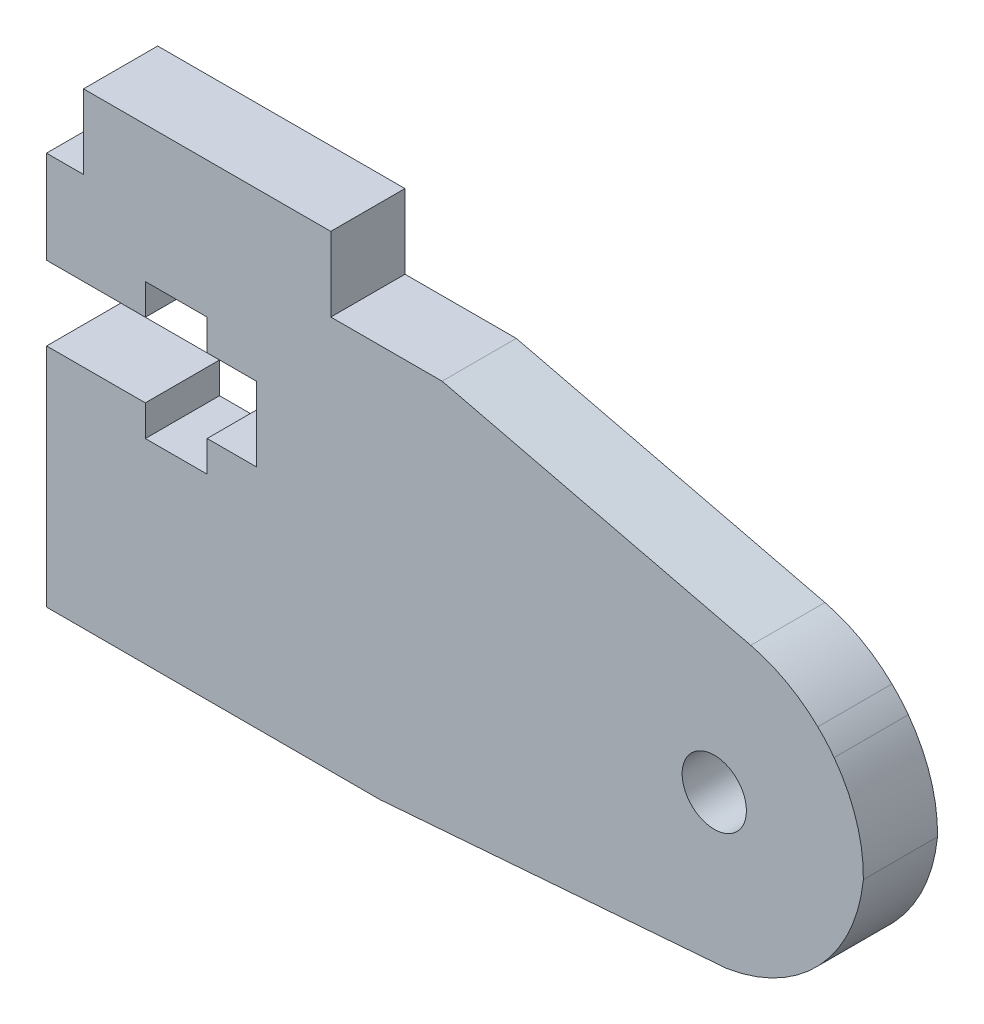
ISO-10303-21;
HEADER;
FILE_DESCRIPTION(('STEP AP214'),'2;1');
FILE_NAME('part.step','',(''),(''),'','','');
FILE_SCHEMA(('AUTOMOTIVE_DESIGN { 1 0 10303 214 1 1 1 1 }'));
ENDSEC;
DATA;
#1=APPLICATION_CONTEXT('core data for automotive mechanical design processes');
#2=APPLICATION_PROTOCOL_DEFINITION('international standard','automotive_design',2000,#1);
#3=PRODUCT_CONTEXT('',#1,'mechanical');
#4=PRODUCT('Part','Part','',(#3));
#5=PRODUCT_RELATED_PRODUCT_CATEGORY('part','',(#4));
#6=PRODUCT_DEFINITION_FORMATION('','',#4);
#7=PRODUCT_DEFINITION_CONTEXT('part definition',#1,'design');
#8=PRODUCT_DEFINITION('design','',#6,#7);
#9=PRODUCT_DEFINITION_SHAPE('','',#8);
#10=(LENGTH_UNIT() NAMED_UNIT(*) SI_UNIT(.MILLI.,.METRE.));
#11=(NAMED_UNIT(*) PLANE_ANGLE_UNIT() SI_UNIT($,.RADIAN.));
#12=(NAMED_UNIT(*) SI_UNIT($,.STERADIAN.) SOLID_ANGLE_UNIT());
#13=UNCERTAINTY_MEASURE_WITH_UNIT(LENGTH_MEASURE(1.E-05),#10,'distance_accuracy_value','');
#14=(GEOMETRIC_REPRESENTATION_CONTEXT(3) GLOBAL_UNCERTAINTY_ASSIGNED_CONTEXT((#13)) GLOBAL_UNIT_ASSIGNED_CONTEXT((#10,
#11,#12)) REPRESENTATION_CONTEXT('',''));
#15=CARTESIAN_POINT('',(0.,0.,0.));
#16=DIRECTION('',(0.,0.,1.));
#17=DIRECTION('',(1.,0.,0.));
#18=AXIS2_PLACEMENT_3D('',#15,#16,#17);
#19=CARTESIAN_POINT('',(2394.87260993681,1568.82173299491,3.));
#20=DIRECTION('',(0.,0.,1.));
#21=DIRECTION('',(1.,0.,0.));
#22=AXIS2_PLACEMENT_3D('',#19,#20,#21);
#23=PLANE('',#22);
#24=DIRECTION('',(0.000790245582121312,-0.999999687755911,0.));
#25=VECTOR('',#24,1.);
#26=CARTESIAN_POINT('',(2368.43482788486,1577.07900171005,3.));
#27=LINE('',#26,#25);
#28=CARTESIAN_POINT('',(2368.43482788486,1577.07900171005,3.));
#29=VERTEX_POINT('',#28);
#30=CARTESIAN_POINT('',(2368.43779125457,1573.32906770271,3.));
#31=VERTEX_POINT('',#30);
#32=EDGE_CURVE('E317',#29,#31,#27,.T.);
#33=ORIENTED_EDGE('',*,*,#32,.T.);
#34=DIRECTION('',(0.999999690037696,0.000787352850806013,0.));
#35=VECTOR('',#34,1.);
#36=CARTESIAN_POINT('',(2368.43779125457,1573.32906770271,3.));
#37=LINE('',#36,#35);
#38=CARTESIAN_POINT('',(2372.43777914393,1573.33221710555,3.));
#39=VERTEX_POINT('',#38);
#40=EDGE_CURVE('E151',#31,#39,#37,.T.);
#41=ORIENTED_EDGE('',*,*,#40,.T.);
#42=DIRECTION('',(-0.000787352849940315,0.999999690037697,0.));
#43=VECTOR('',#42,1.);
#44=CARTESIAN_POINT('',(2372.43777914393,1573.33221710555,3.));
#45=LINE('',#44,#43);
#46=CARTESIAN_POINT('',(2372.43679495286,1574.5822167181,3.));
#47=VERTEX_POINT('',#46);
#48=EDGE_CURVE('E406',#39,#47,#45,.T.);
#49=ORIENTED_EDGE('',*,*,#48,.T.);
#50=DIRECTION('',(0.999999690037696,0.00078735285059927,0.));
#51=VECTOR('',#50,1.);
#52=CARTESIAN_POINT('',(2372.43679495286,1574.5822167181,3.));
#53=LINE('',#52,#51);
#54=CARTESIAN_POINT('',(2374.92933215026,1574.58417922498,3.));
#55=VERTEX_POINT('',#54);
#56=EDGE_CURVE('E426',#47,#55,#53,.T.);
#57=ORIENTED_EDGE('',*,*,#56,.T.);
#58=DIRECTION('',(0.000787352851006129,-0.999999690037696,0.));
#59=VECTOR('',#58,1.);
#60=CARTESIAN_POINT('',(2374.92933215026,1574.58417922498,3.));
#61=LINE('',#60,#59);
#62=CARTESIAN_POINT('',(2374.93031634132,1573.33417961243,3.));
#63=VERTEX_POINT('',#62);
#64=EDGE_CURVE('E422',#55,#63,#61,.T.);
#65=ORIENTED_EDGE('',*,*,#64,.T.);
#66=DIRECTION('',(0.999999690037696,0.000787352851028333,0.));
#67=VECTOR('',#66,1.);
#68=CARTESIAN_POINT('',(2374.93031634132,1573.33417961243,3.));
#69=LINE('',#68,#67);
#70=CARTESIAN_POINT('',(2376.9303157214,1573.33575431813,3.));
#71=VERTEX_POINT('',#70);
#72=EDGE_CURVE('E425',#63,#71,#69,.T.);
#73=ORIENTED_EDGE('',*,*,#72,.T.);
#74=DIRECTION('',(0.000787352851065282,-0.999999690037696,0.));
#75=VECTOR('',#74,1.);
#76=CARTESIAN_POINT('',(2376.9303157214,1573.33575431813,3.));
#77=LINE('',#76,#75);
#78=CARTESIAN_POINT('',(2376.93267777995,1570.33575524802,3.));
#79=VERTEX_POINT('',#78);
#80=EDGE_CURVE('E430',#71,#79,#77,.T.);
#81=ORIENTED_EDGE('',*,*,#80,.T.);
#82=DIRECTION('',(-0.999999690037696,-0.000787352850916786,0.));
#83=VECTOR('',#82,1.);
#84=CARTESIAN_POINT('',(2376.93267777995,1570.33575524802,3.));
#85=LINE('',#84,#83);
#86=CARTESIAN_POINT('',(2374.93267839987,1570.33418054232,3.));
#87=VERTEX_POINT('',#86);
#88=EDGE_CURVE('E437',#79,#87,#85,.T.);
#89=ORIENTED_EDGE('',*,*,#88,.T.);
#90=DIRECTION('',(0.000787352850650857,-0.999999690037696,0.));
#91=VECTOR('',#90,1.);
#92=CARTESIAN_POINT('',(2374.93267839987,1570.33418054232,3.));
#93=LINE('',#92,#91);
#94=CARTESIAN_POINT('',(2374.93366259094,1569.08418092977,3.));
#95=VERTEX_POINT('',#94);
#96=EDGE_CURVE('E440',#87,#95,#93,.T.);
#97=ORIENTED_EDGE('',*,*,#96,.T.);
#98=DIRECTION('',(-0.999999690037696,-0.000787352850828493,0.));
#99=VECTOR('',#98,1.);
#100=CARTESIAN_POINT('',(2374.93366259094,1569.08418092977,3.));
#101=LINE('',#100,#99);
#102=CARTESIAN_POINT('',(2372.43366336584,1569.08221254764,3.));
#103=VERTEX_POINT('',#102);
#104=EDGE_CURVE('E443',#95,#103,#101,.T.);
#105=ORIENTED_EDGE('',*,*,#104,.T.);
#106=DIRECTION('',(-0.000787352850650857,0.999999690037696,0.));
#107=VECTOR('',#106,1.);
#108=CARTESIAN_POINT('',(2372.43366336584,1569.08221254764,3.));
#109=LINE('',#108,#107);
#110=CARTESIAN_POINT('',(2372.43267917478,1570.33221216019,3.));
#111=VERTEX_POINT('',#110);
#112=EDGE_CURVE('E446',#103,#111,#109,.T.);
#113=ORIENTED_EDGE('',*,*,#112,.T.);
#114=DIRECTION('',(-0.999999690037695,-0.000787352851933493,0.));
#115=VECTOR('',#114,1.);
#116=CARTESIAN_POINT('',(2372.43267917478,1570.33221216019,3.));
#117=LINE('',#116,#115);
#118=CARTESIAN_POINT('',(2368.4401581406,1570.32906863639,3.));
#119=VERTEX_POINT('',#118);
#120=EDGE_CURVE('E449',#111,#119,#117,.T.);
#121=ORIENTED_EDGE('',*,*,#120,.T.);
#122=DIRECTION('',(-2.68532883957804E-05,-0.999999999639451,0.));
#123=VECTOR('',#122,1.);
#124=CARTESIAN_POINT('',(2368.43991246039,1561.18008841039,3.));
#125=LINE('',#124,#123);
#126=CARTESIAN_POINT('',(2368.43991246039,1561.18008841039,3.));
#127=VERTEX_POINT('',#126);
#128=EDGE_CURVE('E452',#119,#127,#125,.T.);
#129=ORIENTED_EDGE('',*,*,#128,.T.);
#130=DIRECTION('',(1.,0.,0.));
#131=VECTOR('',#130,1.);
#132=CARTESIAN_POINT('',(2368.43991246039,1561.18008841039,3.));
#133=LINE('',#132,#131);
#134=CARTESIAN_POINT('',(2381.92828809636,1561.18008841039,3.));
#135=VERTEX_POINT('',#134);
#136=EDGE_CURVE('E455',#127,#135,#133,.T.);
#137=ORIENTED_EDGE('',*,*,#136,.T.);
#138=DIRECTION('',(0.996947099942348,0.0780799584819445,0.));
#139=VECTOR('',#138,1.);
#140=CARTESIAN_POINT('',(2381.92828809636,1561.18008841039,3.));
#141=LINE('',#140,#139);
#142=CARTESIAN_POINT('',(2395.95797965958,1562.27888064805,3.));
#143=VERTEX_POINT('',#142);
#144=EDGE_CURVE('E458',#135,#143,#141,.T.);
#145=ORIENTED_EDGE('',*,*,#144,.T.);
#146=CARTESIAN_POINT('',(2394.87260993681,1568.82173299491,3.));
#147=DIRECTION('',(0.,0.,1.));
#148=DIRECTION('',(1.,0.,0.));
#149=AXIS2_PLACEMENT_3D('',#146,#147,#148);
#150=CIRCLE('',#149,6.63226539486123);
#151=CARTESIAN_POINT('',(2401.47127772232,1568.15500387121,3.));
#152=VERTEX_POINT('',#151);
#153=EDGE_CURVE('E461',#143,#152,#150,.T.);
#154=ORIENTED_EDGE('',*,*,#153,.T.);
#155=CARTESIAN_POINT('',(2395.47220538566,1568.25920494779,3.));
#156=DIRECTION('',(0.,0.,1.));
#157=DIRECTION('',(1.,0.,0.));
#158=AXIS2_PLACEMENT_3D('',#155,#156,#157);
#159=CIRCLE('',#158,5.99997723035891);
#160=CARTESIAN_POINT('',(2400.28990127993,1571.83545060982,3.));
#161=VERTEX_POINT('',#160);
#162=EDGE_CURVE('E464',#152,#161,#159,.T.);
#163=ORIENTED_EDGE('',*,*,#162,.T.);
#164=CARTESIAN_POINT('',(2395.42432323944,1568.21704800601,3.));
#165=DIRECTION('',(0.,0.,1.));
#166=DIRECTION('',(1.,0.,0.));
#167=AXIS2_PLACEMENT_3D('',#164,#165,#166);
#168=CIRCLE('',#167,6.06355399673735);
#169=CARTESIAN_POINT('',(2399.62985552251,1572.58513514884,3.));
#170=VERTEX_POINT('',#169);
#171=EDGE_CURVE('E467',#161,#170,#168,.T.);
#172=ORIENTED_EDGE('',*,*,#171,.T.);
#173=CARTESIAN_POINT('',(2395.47220538566,1568.25920494779,3.));
#174=DIRECTION('',(0.,0.,1.));
#175=DIRECTION('',(1.,0.,0.));
#176=AXIS2_PLACEMENT_3D('',#173,#174,#175);
#177=CIRCLE('',#176,5.9999772303592);
#178=CARTESIAN_POINT('',(2396.91728976,1574.0825594721,3.));
#179=VERTEX_POINT('',#178);
#180=EDGE_CURVE('E470',#170,#179,#177,.T.);
#181=ORIENTED_EDGE('',*,*,#180,.T.);
#182=DIRECTION('',(-0.972152676146563,0.234348403581239,0.));
#183=VECTOR('',#182,1.);
#184=CARTESIAN_POINT('',(2396.91728976,1574.0825594721,3.));
#185=LINE('',#184,#183);
#186=CARTESIAN_POINT('',(2384.43482292546,1577.09159935566,3.));
#187=VERTEX_POINT('',#186);
#188=EDGE_CURVE('E473',#179,#187,#185,.T.);
#189=ORIENTED_EDGE('',*,*,#188,.T.);
#190=DIRECTION('',(-0.999999690037696,-0.000787352850670517,0.));
#191=VECTOR('',#190,1.);
#192=CARTESIAN_POINT('',(2384.43482292546,1577.09159935566,3.));
#193=LINE('',#192,#191);
#194=CARTESIAN_POINT('',(2379.93482432029,1577.08805626783,3.));
#195=VERTEX_POINT('',#194);
#196=EDGE_CURVE('E476',#187,#195,#193,.T.);
#197=ORIENTED_EDGE('',*,*,#196,.T.);
#198=DIRECTION('',(-0.000787352850915971,0.999999690037696,0.));
#199=VECTOR('',#198,1.);
#200=CARTESIAN_POINT('',(2379.93482432029,1577.08805626783,3.));
#201=LINE('',#200,#199);
#202=CARTESIAN_POINT('',(2379.93246226173,1580.08805533795,3.));
#203=VERTEX_POINT('',#202);
#204=EDGE_CURVE('E221',#195,#203,#201,.T.);
#205=ORIENTED_EDGE('',*,*,#204,.T.);
#206=DIRECTION('',(-0.999999690037696,-0.000787352850806289,0.));
#207=VECTOR('',#206,1.);
#208=CARTESIAN_POINT('',(2369.93246536136,1580.08018180944,3.));
#209=LINE('',#208,#207);
#210=CARTESIAN_POINT('',(2369.93246536136,1580.08018180944,3.));
#211=VERTEX_POINT('',#210);
#212=EDGE_CURVE('E215',#203,#211,#209,.T.);
#213=ORIENTED_EDGE('',*,*,#212,.T.);
#214=DIRECTION('',(0.000787352850917311,-0.999999690037696,0.));
#215=VECTOR('',#214,1.);
#216=CARTESIAN_POINT('',(2369.93482741991,1577.08018273933,3.));
#217=LINE('',#216,#215);
#218=CARTESIAN_POINT('',(2369.93482741991,1577.08018273933,3.));
#219=VERTEX_POINT('',#218);
#220=EDGE_CURVE('E219',#211,#219,#217,.T.);
#221=ORIENTED_EDGE('',*,*,#220,.T.);
#222=DIRECTION('',(-0.999999690037696,-0.000787352851364896,0.));
#223=VECTOR('',#222,1.);
#224=CARTESIAN_POINT('',(2368.43482788486,1577.07900171005,3.));
#225=LINE('',#224,#223);
#226=EDGE_CURVE('E57',#219,#29,#225,.T.);
#227=ORIENTED_EDGE('',*,*,#226,.T.);
#228=EDGE_LOOP('',(#33,#41,#49,#57,#65,#73,#81,#89,#97,#105,#113,#121,#129,#137,#145,#154,#163,
#172,#181,#189,#197,#205,#213,#221,#227));
#229=FACE_BOUND('',#228,.T.);
#230=CARTESIAN_POINT('',(2395.44182695624,1568.20026299569,3.));
#231=DIRECTION('',(0.,0.,1.));
#232=DIRECTION('',(1.,0.,0.));
#233=AXIS2_PLACEMENT_3D('',#230,#231,#232);
#234=CIRCLE('',#233,1.29999999999999);
#235=CARTESIAN_POINT('',(2396.74182695624,1568.20026299569,3.));
#236=VERTEX_POINT('',#235);
#237=EDGE_CURVE('E248',#236,#236,#234,.T.);
#238=ORIENTED_EDGE('',*,*,#237,.F.);
#239=EDGE_LOOP('',(#238));
#240=FACE_BOUND('',#239,.T.);
#241=ADVANCED_FACE('F39',(#229,#240),#23,.T.);
#242=CARTESIAN_POINT('',(2394.87260993681,1568.82173299491,0.));
#243=DIRECTION('',(0.,0.,1.));
#244=DIRECTION('',(1.,0.,0.));
#245=AXIS2_PLACEMENT_3D('',#242,#243,#244);
#246=PLANE('',#245);
#247=DIRECTION('',(0.000790245582121312,-0.999999687755911,0.));
#248=VECTOR('',#247,1.);
#249=CARTESIAN_POINT('',(2368.43482788486,1577.07900171005,0.));
#250=LINE('',#249,#248);
#251=CARTESIAN_POINT('',(2368.43482788486,1577.07900171005,0.));
#252=VERTEX_POINT('',#251);
#253=CARTESIAN_POINT('',(2368.43779125457,1573.32906770271,0.));
#254=VERTEX_POINT('',#253);
#255=EDGE_CURVE('E243',#252,#254,#250,.T.);
#256=ORIENTED_EDGE('',*,*,#255,.F.);
#257=DIRECTION('',(-0.999999690037696,-0.000787352851364896,0.));
#258=VECTOR('',#257,1.);
#259=CARTESIAN_POINT('',(2368.43482788486,1577.07900171005,0.));
#260=LINE('',#259,#258);
#261=CARTESIAN_POINT('',(2369.93482741991,1577.08018273933,0.));
#262=VERTEX_POINT('',#261);
#263=EDGE_CURVE('E143',#262,#252,#260,.T.);
#264=ORIENTED_EDGE('',*,*,#263,.F.);
#265=DIRECTION('',(0.000787352850917311,-0.999999690037696,0.));
#266=VECTOR('',#265,1.);
#267=CARTESIAN_POINT('',(2369.93482741991,1577.08018273933,0.));
#268=LINE('',#267,#266);
#269=CARTESIAN_POINT('',(2369.93246536136,1580.08018180944,0.));
#270=VERTEX_POINT('',#269);
#271=EDGE_CURVE('E137',#270,#262,#268,.T.);
#272=ORIENTED_EDGE('',*,*,#271,.F.);
#273=DIRECTION('',(-0.999999690037696,-0.000787352850806289,0.));
#274=VECTOR('',#273,1.);
#275=CARTESIAN_POINT('',(2369.93246536136,1580.08018180944,0.));
#276=LINE('',#275,#274);
#277=CARTESIAN_POINT('',(2379.93246226173,1580.08805533795,0.));
#278=VERTEX_POINT('',#277);
#279=EDGE_CURVE('E230',#278,#270,#276,.T.);
#280=ORIENTED_EDGE('',*,*,#279,.F.);
#281=DIRECTION('',(-0.000787352850915971,0.999999690037696,0.));
#282=VECTOR('',#281,1.);
#283=CARTESIAN_POINT('',(2379.93482432029,1577.08805626783,0.));
#284=LINE('',#283,#282);
#285=CARTESIAN_POINT('',(2379.93482432029,1577.08805626783,0.));
#286=VERTEX_POINT('',#285);
#287=EDGE_CURVE('E308',#286,#278,#284,.T.);
#288=ORIENTED_EDGE('',*,*,#287,.F.);
#289=DIRECTION('',(-0.999999690037696,-0.000787352850670517,0.));
#290=VECTOR('',#289,1.);
#291=CARTESIAN_POINT('',(2384.43482292546,1577.09159935566,0.));
#292=LINE('',#291,#290);
#293=CARTESIAN_POINT('',(2384.43482292546,1577.09159935566,0.));
#294=VERTEX_POINT('',#293);
#295=EDGE_CURVE('E305',#294,#286,#292,.T.);
#296=ORIENTED_EDGE('',*,*,#295,.F.);
#297=DIRECTION('',(-0.972152676146563,0.234348403581239,0.));
#298=VECTOR('',#297,1.);
#299=CARTESIAN_POINT('',(2396.91728976,1574.0825594721,0.));
#300=LINE('',#299,#298);
#301=CARTESIAN_POINT('',(2396.91728976,1574.0825594721,0.));
#302=VERTEX_POINT('',#301);
#303=EDGE_CURVE('E302',#302,#294,#300,.T.);
#304=ORIENTED_EDGE('',*,*,#303,.F.);
#305=CARTESIAN_POINT('',(2395.47220538566,1568.25920494779,0.));
#306=DIRECTION('',(0.,0.,1.));
#307=DIRECTION('',(1.,0.,0.));
#308=AXIS2_PLACEMENT_3D('',#305,#306,#307);
#309=CIRCLE('',#308,5.9999772303592);
#310=CARTESIAN_POINT('',(2399.62985552251,1572.58513514884,0.));
#311=VERTEX_POINT('',#310);
#312=EDGE_CURVE('E299',#311,#302,#309,.T.);
#313=ORIENTED_EDGE('',*,*,#312,.F.);
#314=CARTESIAN_POINT('',(2395.42432323944,1568.21704800601,0.));
#315=DIRECTION('',(0.,0.,1.));
#316=DIRECTION('',(1.,0.,0.));
#317=AXIS2_PLACEMENT_3D('',#314,#315,#316);
#318=CIRCLE('',#317,6.06355399673735);
#319=CARTESIAN_POINT('',(2400.28990127993,1571.83545060982,0.));
#320=VERTEX_POINT('',#319);
#321=EDGE_CURVE('E296',#320,#311,#318,.T.);
#322=ORIENTED_EDGE('',*,*,#321,.F.);
#323=CARTESIAN_POINT('',(2395.47220538566,1568.25920494779,0.));
#324=DIRECTION('',(0.,0.,1.));
#325=DIRECTION('',(1.,0.,0.));
#326=AXIS2_PLACEMENT_3D('',#323,#324,#325);
#327=CIRCLE('',#326,5.99997723035891);
#328=CARTESIAN_POINT('',(2401.47127772232,1568.15500387121,0.));
#329=VERTEX_POINT('',#328);
#330=EDGE_CURVE('E293',#329,#320,#327,.T.);
#331=ORIENTED_EDGE('',*,*,#330,.F.);
#332=CARTESIAN_POINT('',(2394.87260993681,1568.82173299491,0.));
#333=DIRECTION('',(0.,0.,1.));
#334=DIRECTION('',(1.,0.,0.));
#335=AXIS2_PLACEMENT_3D('',#332,#333,#334);
#336=CIRCLE('',#335,6.63226539486123);
#337=CARTESIAN_POINT('',(2395.95797965958,1562.27888064805,0.));
#338=VERTEX_POINT('',#337);
#339=EDGE_CURVE('E290',#338,#329,#336,.T.);
#340=ORIENTED_EDGE('',*,*,#339,.F.);
#341=DIRECTION('',(0.996947099942348,0.0780799584819445,0.));
#342=VECTOR('',#341,1.);
#343=CARTESIAN_POINT('',(2381.92828809636,1561.18008841039,0.));
#344=LINE('',#343,#342);
#345=CARTESIAN_POINT('',(2381.92828809636,1561.18008841039,0.));
#346=VERTEX_POINT('',#345);
#347=EDGE_CURVE('E287',#346,#338,#344,.T.);
#348=ORIENTED_EDGE('',*,*,#347,.F.);
#349=DIRECTION('',(1.,0.,0.));
#350=VECTOR('',#349,1.);
#351=CARTESIAN_POINT('',(2368.43991246039,1561.18008841039,0.));
#352=LINE('',#351,#350);
#353=CARTESIAN_POINT('',(2368.43991246039,1561.18008841039,0.));
#354=VERTEX_POINT('',#353);
#355=EDGE_CURVE('E284',#354,#346,#352,.T.);
#356=ORIENTED_EDGE('',*,*,#355,.F.);
#357=DIRECTION('',(-2.68532883957804E-05,-0.999999999639451,0.));
#358=VECTOR('',#357,1.);
#359=CARTESIAN_POINT('',(2368.43991246039,1561.18008841039,0.));
#360=LINE('',#359,#358);
#361=CARTESIAN_POINT('',(2368.4401581406,1570.32906863639,0.));
#362=VERTEX_POINT('',#361);
#363=EDGE_CURVE('E281',#362,#354,#360,.T.);
#364=ORIENTED_EDGE('',*,*,#363,.F.);
#365=DIRECTION('',(-0.999999690037695,-0.000787352851933493,0.));
#366=VECTOR('',#365,1.);
#367=CARTESIAN_POINT('',(2372.43267917478,1570.33221216019,0.));
#368=LINE('',#367,#366);
#369=CARTESIAN_POINT('',(2372.43267917478,1570.33221216019,0.));
#370=VERTEX_POINT('',#369);
#371=EDGE_CURVE('E278',#370,#362,#368,.T.);
#372=ORIENTED_EDGE('',*,*,#371,.F.);
#373=DIRECTION('',(-0.000787352850650857,0.999999690037696,0.));
#374=VECTOR('',#373,1.);
#375=CARTESIAN_POINT('',(2372.43366336584,1569.08221254764,0.));
#376=LINE('',#375,#374);
#377=CARTESIAN_POINT('',(2372.43366336584,1569.08221254764,0.));
#378=VERTEX_POINT('',#377);
#379=EDGE_CURVE('E275',#378,#370,#376,.T.);
#380=ORIENTED_EDGE('',*,*,#379,.F.);
#381=DIRECTION('',(-0.999999690037696,-0.000787352850828493,0.));
#382=VECTOR('',#381,1.);
#383=CARTESIAN_POINT('',(2374.93366259094,1569.08418092977,0.));
#384=LINE('',#383,#382);
#385=CARTESIAN_POINT('',(2374.93366259094,1569.08418092977,0.));
#386=VERTEX_POINT('',#385);
#387=EDGE_CURVE('E272',#386,#378,#384,.T.);
#388=ORIENTED_EDGE('',*,*,#387,.F.);
#389=DIRECTION('',(0.000787352850650857,-0.999999690037696,0.));
#390=VECTOR('',#389,1.);
#391=CARTESIAN_POINT('',(2374.93267839987,1570.33418054232,0.));
#392=LINE('',#391,#390);
#393=CARTESIAN_POINT('',(2374.93267839987,1570.33418054232,0.));
#394=VERTEX_POINT('',#393);
#395=EDGE_CURVE('E269',#394,#386,#392,.T.);
#396=ORIENTED_EDGE('',*,*,#395,.F.);
#397=DIRECTION('',(-0.999999690037696,-0.000787352850916786,0.));
#398=VECTOR('',#397,1.);
#399=CARTESIAN_POINT('',(2376.93267777995,1570.33575524802,0.));
#400=LINE('',#399,#398);
#401=CARTESIAN_POINT('',(2376.93267777995,1570.33575524802,0.));
#402=VERTEX_POINT('',#401);
#403=EDGE_CURVE('E266',#402,#394,#400,.T.);
#404=ORIENTED_EDGE('',*,*,#403,.F.);
#405=DIRECTION('',(0.000787352851065282,-0.999999690037696,0.));
#406=VECTOR('',#405,1.);
#407=CARTESIAN_POINT('',(2376.9303157214,1573.33575431813,0.));
#408=LINE('',#407,#406);
#409=CARTESIAN_POINT('',(2376.9303157214,1573.33575431813,0.));
#410=VERTEX_POINT('',#409);
#411=EDGE_CURVE('E263',#410,#402,#408,.T.);
#412=ORIENTED_EDGE('',*,*,#411,.F.);
#413=DIRECTION('',(0.999999690037696,0.000787352851028333,0.));
#414=VECTOR('',#413,1.);
#415=CARTESIAN_POINT('',(2374.93031634132,1573.33417961243,0.));
#416=LINE('',#415,#414);
#417=CARTESIAN_POINT('',(2374.93031634132,1573.33417961243,0.));
#418=VERTEX_POINT('',#417);
#419=EDGE_CURVE('E260',#418,#410,#416,.T.);
#420=ORIENTED_EDGE('',*,*,#419,.F.);
#421=DIRECTION('',(0.000787352851006129,-0.999999690037696,0.));
#422=VECTOR('',#421,1.);
#423=CARTESIAN_POINT('',(2374.92933215026,1574.58417922498,0.));
#424=LINE('',#423,#422);
#425=CARTESIAN_POINT('',(2374.92933215026,1574.58417922498,0.));
#426=VERTEX_POINT('',#425);
#427=EDGE_CURVE('E257',#426,#418,#424,.T.);
#428=ORIENTED_EDGE('',*,*,#427,.F.);
#429=DIRECTION('',(0.999999690037696,0.00078735285059927,0.));
#430=VECTOR('',#429,1.);
#431=CARTESIAN_POINT('',(2372.43679495286,1574.5822167181,0.));
#432=LINE('',#431,#430);
#433=CARTESIAN_POINT('',(2372.43679495286,1574.5822167181,0.));
#434=VERTEX_POINT('',#433);
#435=EDGE_CURVE('E254',#434,#426,#432,.T.);
#436=ORIENTED_EDGE('',*,*,#435,.F.);
#437=DIRECTION('',(-0.000787352849940315,0.999999690037697,0.));
#438=VECTOR('',#437,1.);
#439=CARTESIAN_POINT('',(2372.43777914393,1573.33221710555,0.));
#440=LINE('',#439,#438);
#441=CARTESIAN_POINT('',(2372.43777914393,1573.33221710555,0.));
#442=VERTEX_POINT('',#441);
#443=EDGE_CURVE('E251',#442,#434,#440,.T.);
#444=ORIENTED_EDGE('',*,*,#443,.F.);
#445=DIRECTION('',(0.999999690037696,0.000787352850806013,0.));
#446=VECTOR('',#445,1.);
#447=CARTESIAN_POINT('',(2368.43779125457,1573.32906770271,0.));
#448=LINE('',#447,#446);
#449=EDGE_CURVE('E247',#254,#442,#448,.T.);
#450=ORIENTED_EDGE('',*,*,#449,.F.);
#451=EDGE_LOOP('',(#256,#264,#272,#280,#288,#296,#304,#313,#322,#331,#340,#348,#356,#364,#372,
#380,#388,#396,#404,#412,#420,#428,#436,#444,#450));
#452=FACE_BOUND('',#451,.T.);
#453=CARTESIAN_POINT('',(2395.44182695624,1568.20026299569,0.));
#454=DIRECTION('',(0.,0.,1.));
#455=DIRECTION('',(1.,0.,0.));
#456=AXIS2_PLACEMENT_3D('',#453,#454,#455);
#457=CIRCLE('',#456,1.29999999999999);
#458=CARTESIAN_POINT('',(2396.74182695624,1568.20026299569,0.));
#459=VERTEX_POINT('',#458);
#460=EDGE_CURVE('E794',#459,#459,#457,.T.);
#461=ORIENTED_EDGE('',*,*,#460,.T.);
#462=EDGE_LOOP('',(#461));
#463=FACE_BOUND('',#462,.T.);
#464=ADVANCED_FACE('F410',(#452,#463),#246,.F.);
#465=CARTESIAN_POINT('',(2368.43482788486,1577.07900171005,3.));
#466=DIRECTION('',(0.999999687755911,0.000790245582121312,0.));
#467=DIRECTION('',(-0.000790245582121312,0.999999687755911,0.));
#468=AXIS2_PLACEMENT_3D('',#465,#466,#467);
#469=PLANE('',#468);
#470=ORIENTED_EDGE('',*,*,#255,.T.);
#471=DIRECTION('',(0.,0.,-1.));
#472=VECTOR('',#471,1.);
#473=CARTESIAN_POINT('',(2368.43779125457,1573.32906770271,3.));
#474=LINE('',#473,#472);
#475=EDGE_CURVE('E11',#31,#254,#474,.T.);
#476=ORIENTED_EDGE('',*,*,#475,.F.);
#477=ORIENTED_EDGE('',*,*,#32,.F.);
#478=DIRECTION('',(0.,0.,-1.));
#479=VECTOR('',#478,1.);
#480=CARTESIAN_POINT('',(2368.43482788486,1577.07900171005,3.));
#481=LINE('',#480,#479);
#482=EDGE_CURVE('E239',#29,#252,#481,.T.);
#483=ORIENTED_EDGE('',*,*,#482,.T.);
#484=EDGE_LOOP('',(#470,#476,#477,#483));
#485=FACE_BOUND('',#484,.T.);
#486=ADVANCED_FACE('F41',(#485),#469,.F.);
#487=CARTESIAN_POINT('',(2368.43779125457,1573.32906770271,3.));
#488=DIRECTION('',(-0.000787352850806013,0.999999690037696,0.));
#489=DIRECTION('',(-0.999999690037696,-0.000787352850806013,0.));
#490=AXIS2_PLACEMENT_3D('',#487,#488,#489);
#491=PLANE('',#490);
#492=ORIENTED_EDGE('',*,*,#449,.T.);
#493=DIRECTION('',(0.,0.,-1.));
#494=VECTOR('',#493,1.);
#495=CARTESIAN_POINT('',(2372.43777914393,1573.33221710555,3.));
#496=LINE('',#495,#494);
#497=EDGE_CURVE('E49',#39,#442,#496,.T.);
#498=ORIENTED_EDGE('',*,*,#497,.F.);
#499=ORIENTED_EDGE('',*,*,#40,.F.);
#500=ORIENTED_EDGE('',*,*,#475,.T.);
#501=EDGE_LOOP('',(#492,#498,#499,#500));
#502=FACE_BOUND('',#501,.T.);
#503=ADVANCED_FACE('F512',(#502),#491,.F.);
#504=CARTESIAN_POINT('',(2372.43777914393,1573.33221710555,3.));
#505=DIRECTION('',(-0.999999690037697,-0.000787352849940315,0.));
#506=DIRECTION('',(0.000787352849940315,-0.999999690037697,0.));
#507=AXIS2_PLACEMENT_3D('',#504,#505,#506);
#508=PLANE('',#507);
#509=ORIENTED_EDGE('',*,*,#443,.T.);
#510=DIRECTION('',(0.,0.,-1.));
#511=VECTOR('',#510,1.);
#512=CARTESIAN_POINT('',(2372.43679495286,1574.5822167181,3.));
#513=LINE('',#512,#511);
#514=EDGE_CURVE('E396',#47,#434,#513,.T.);
#515=ORIENTED_EDGE('',*,*,#514,.F.);
#516=ORIENTED_EDGE('',*,*,#48,.F.);
#517=ORIENTED_EDGE('',*,*,#497,.T.);
#518=EDGE_LOOP('',(#509,#515,#516,#517));
#519=FACE_BOUND('',#518,.T.);
#520=ADVANCED_FACE('F404',(#519),#508,.F.);
#521=CARTESIAN_POINT('',(2372.43679495286,1574.5822167181,3.));
#522=DIRECTION('',(-0.00078735285059927,0.999999690037696,0.));
#523=DIRECTION('',(-0.999999690037696,-0.00078735285059927,0.));
#524=AXIS2_PLACEMENT_3D('',#521,#522,#523);
#525=PLANE('',#524);
#526=ORIENTED_EDGE('',*,*,#435,.T.);
#527=DIRECTION('',(0.,0.,-1.));
#528=VECTOR('',#527,1.);
#529=CARTESIAN_POINT('',(2374.92933215026,1574.58417922498,3.));
#530=LINE('',#529,#528);
#531=EDGE_CURVE('E392',#55,#426,#530,.T.);
#532=ORIENTED_EDGE('',*,*,#531,.F.);
#533=ORIENTED_EDGE('',*,*,#56,.F.);
#534=ORIENTED_EDGE('',*,*,#514,.T.);
#535=EDGE_LOOP('',(#526,#532,#533,#534));
#536=FACE_BOUND('',#535,.T.);
#537=ADVANCED_FACE('F416',(#536),#525,.F.);
#538=CARTESIAN_POINT('',(2374.92933215026,1574.58417922498,3.));
#539=DIRECTION('',(0.999999690037696,0.000787352851006129,0.));
#540=DIRECTION('',(-0.000787352851006129,0.999999690037696,0.));
#541=AXIS2_PLACEMENT_3D('',#538,#539,#540);
#542=PLANE('',#541);
#543=ORIENTED_EDGE('',*,*,#427,.T.);
#544=DIRECTION('',(0.,0.,-1.));
#545=VECTOR('',#544,1.);
#546=CARTESIAN_POINT('',(2374.93031634132,1573.33417961243,3.));
#547=LINE('',#546,#545);
#548=EDGE_CURVE('E388',#63,#418,#547,.T.);
#549=ORIENTED_EDGE('',*,*,#548,.F.);
#550=ORIENTED_EDGE('',*,*,#64,.F.);
#551=ORIENTED_EDGE('',*,*,#531,.T.);
#552=EDGE_LOOP('',(#543,#549,#550,#551));
#553=FACE_BOUND('',#552,.T.);
#554=ADVANCED_FACE('F420',(#553),#542,.F.);
#555=CARTESIAN_POINT('',(2374.93031634132,1573.33417961243,3.));
#556=DIRECTION('',(-0.000787352851028333,0.999999690037696,0.));
#557=DIRECTION('',(-0.999999690037696,-0.000787352851028333,0.));
#558=AXIS2_PLACEMENT_3D('',#555,#556,#557);
#559=PLANE('',#558);
#560=ORIENTED_EDGE('',*,*,#419,.T.);
#561=DIRECTION('',(0.,0.,-1.));
#562=VECTOR('',#561,1.);
#563=CARTESIAN_POINT('',(2376.9303157214,1573.33575431813,3.));
#564=LINE('',#563,#562);
#565=EDGE_CURVE('E384',#71,#410,#564,.T.);
#566=ORIENTED_EDGE('',*,*,#565,.F.);
#567=ORIENTED_EDGE('',*,*,#72,.F.);
#568=ORIENTED_EDGE('',*,*,#548,.T.);
#569=EDGE_LOOP('',(#560,#566,#567,#568));
#570=FACE_BOUND('',#569,.T.);
#571=ADVANCED_FACE('F525',(#570),#559,.F.);
#572=CARTESIAN_POINT('',(2376.9303157214,1573.33575431813,3.));
#573=DIRECTION('',(0.999999690037696,0.000787352851065282,0.));
#574=DIRECTION('',(-0.000787352851065282,0.999999690037696,0.));
#575=AXIS2_PLACEMENT_3D('',#572,#573,#574);
#576=PLANE('',#575);
#577=ORIENTED_EDGE('',*,*,#411,.T.);
#578=DIRECTION('',(0.,0.,-1.));
#579=VECTOR('',#578,1.);
#580=CARTESIAN_POINT('',(2376.93267777995,1570.33575524802,3.));
#581=LINE('',#580,#579);
#582=EDGE_CURVE('E380',#79,#402,#581,.T.);
#583=ORIENTED_EDGE('',*,*,#582,.F.);
#584=ORIENTED_EDGE('',*,*,#80,.F.);
#585=ORIENTED_EDGE('',*,*,#565,.T.);
#586=EDGE_LOOP('',(#577,#583,#584,#585));
#587=FACE_BOUND('',#586,.T.);
#588=ADVANCED_FACE('F528',(#587),#576,.F.);
#589=CARTESIAN_POINT('',(2376.93267777995,1570.33575524802,3.));
#590=DIRECTION('',(0.000787352850916786,-0.999999690037696,0.));
#591=DIRECTION('',(0.999999690037696,0.000787352850916786,0.));
#592=AXIS2_PLACEMENT_3D('',#589,#590,#591);
#593=PLANE('',#592);
#594=ORIENTED_EDGE('',*,*,#403,.T.);
#595=DIRECTION('',(0.,0.,-1.));
#596=VECTOR('',#595,1.);
#597=CARTESIAN_POINT('',(2374.93267839987,1570.33418054232,3.));
#598=LINE('',#597,#596);
#599=EDGE_CURVE('E376',#87,#394,#598,.T.);
#600=ORIENTED_EDGE('',*,*,#599,.F.);
#601=ORIENTED_EDGE('',*,*,#88,.F.);
#602=ORIENTED_EDGE('',*,*,#582,.T.);
#603=EDGE_LOOP('',(#594,#600,#601,#602));
#604=FACE_BOUND('',#603,.T.);
#605=ADVANCED_FACE('F532',(#604),#593,.F.);
#606=CARTESIAN_POINT('',(2374.93267839987,1570.33418054232,3.));
#607=DIRECTION('',(0.999999690037696,0.000787352850650857,0.));
#608=DIRECTION('',(-0.000787352850650858,0.999999690037696,0.));
#609=AXIS2_PLACEMENT_3D('',#606,#607,#608);
#610=PLANE('',#609);
#611=ORIENTED_EDGE('',*,*,#395,.T.);
#612=DIRECTION('',(0.,0.,-1.));
#613=VECTOR('',#612,1.);
#614=CARTESIAN_POINT('',(2374.93366259094,1569.08418092977,3.));
#615=LINE('',#614,#613);
#616=EDGE_CURVE('E372',#95,#386,#615,.T.);
#617=ORIENTED_EDGE('',*,*,#616,.F.);
#618=ORIENTED_EDGE('',*,*,#96,.F.);
#619=ORIENTED_EDGE('',*,*,#599,.T.);
#620=EDGE_LOOP('',(#611,#617,#618,#619));
#621=FACE_BOUND('',#620,.T.);
#622=ADVANCED_FACE('F536',(#621),#610,.F.);
#623=CARTESIAN_POINT('',(2374.93366259094,1569.08418092977,3.));
#624=DIRECTION('',(0.000787352850828493,-0.999999690037696,0.));
#625=DIRECTION('',(0.999999690037696,0.000787352850828493,0.));
#626=AXIS2_PLACEMENT_3D('',#623,#624,#625);
#627=PLANE('',#626);
#628=ORIENTED_EDGE('',*,*,#387,.T.);
#629=DIRECTION('',(0.,0.,-1.));
#630=VECTOR('',#629,1.);
#631=CARTESIAN_POINT('',(2372.43366336584,1569.08221254764,3.));
#632=LINE('',#631,#630);
#633=EDGE_CURVE('E368',#103,#378,#632,.T.);
#634=ORIENTED_EDGE('',*,*,#633,.F.);
#635=ORIENTED_EDGE('',*,*,#104,.F.);
#636=ORIENTED_EDGE('',*,*,#616,.T.);
#637=EDGE_LOOP('',(#628,#634,#635,#636));
#638=FACE_BOUND('',#637,.T.);
#639=ADVANCED_FACE('F540',(#638),#627,.F.);
#640=CARTESIAN_POINT('',(2372.43366336584,1569.08221254764,3.));
#641=DIRECTION('',(-0.999999690037696,-0.000787352850650857,0.));
#642=DIRECTION('',(0.000787352850650858,-0.999999690037696,0.));
#643=AXIS2_PLACEMENT_3D('',#640,#641,#642);
#644=PLANE('',#643);
#645=ORIENTED_EDGE('',*,*,#379,.T.);
#646=DIRECTION('',(0.,0.,-1.));
#647=VECTOR('',#646,1.);
#648=CARTESIAN_POINT('',(2372.43267917478,1570.33221216019,3.));
#649=LINE('',#648,#647);
#650=EDGE_CURVE('E364',#111,#370,#649,.T.);
#651=ORIENTED_EDGE('',*,*,#650,.F.);
#652=ORIENTED_EDGE('',*,*,#112,.F.);
#653=ORIENTED_EDGE('',*,*,#633,.T.);
#654=EDGE_LOOP('',(#645,#651,#652,#653));
#655=FACE_BOUND('',#654,.T.);
#656=ADVANCED_FACE('F544',(#655),#644,.F.);
#657=CARTESIAN_POINT('',(2372.43267917478,1570.33221216019,3.));
#658=DIRECTION('',(0.000787352851933493,-0.999999690037695,0.));
#659=DIRECTION('',(0.999999690037695,0.000787352851933493,0.));
#660=AXIS2_PLACEMENT_3D('',#657,#658,#659);
#661=PLANE('',#660);
#662=ORIENTED_EDGE('',*,*,#371,.T.);
#663=DIRECTION('',(0.,0.,-1.));
#664=VECTOR('',#663,1.);
#665=CARTESIAN_POINT('',(2368.4401581406,1570.32906863639,3.));
#666=LINE('',#665,#664);
#667=EDGE_CURVE('E360',#119,#362,#666,.T.);
#668=ORIENTED_EDGE('',*,*,#667,.F.);
#669=ORIENTED_EDGE('',*,*,#120,.F.);
#670=ORIENTED_EDGE('',*,*,#650,.T.);
#671=EDGE_LOOP('',(#662,#668,#669,#670));
#672=FACE_BOUND('',#671,.T.);
#673=ADVANCED_FACE('F548',(#672),#661,.F.);
#674=CARTESIAN_POINT('',(2368.43991246039,1561.18008841039,3.));
#675=DIRECTION('',(0.99999999963945,-2.68532883957804E-05,0.));
#676=DIRECTION('',(2.68532883957804E-05,0.999999999639451,0.));
#677=AXIS2_PLACEMENT_3D('',#674,#675,#676);
#678=PLANE('',#677);
#679=ORIENTED_EDGE('',*,*,#363,.T.);
#680=DIRECTION('',(0.,0.,-1.));
#681=VECTOR('',#680,1.);
#682=CARTESIAN_POINT('',(2368.43991246039,1561.18008841039,3.));
#683=LINE('',#682,#681);
#684=EDGE_CURVE('E356',#127,#354,#683,.T.);
#685=ORIENTED_EDGE('',*,*,#684,.F.);
#686=ORIENTED_EDGE('',*,*,#128,.F.);
#687=ORIENTED_EDGE('',*,*,#667,.T.);
#688=EDGE_LOOP('',(#679,#685,#686,#687));
#689=FACE_BOUND('',#688,.T.);
#690=ADVANCED_FACE('F552',(#689),#678,.F.);
#691=CARTESIAN_POINT('',(2368.43991246039,1561.18008841039,3.));
#692=DIRECTION('',(0.,1.,0.));
#693=DIRECTION('',(0.,0.,1.));
#694=AXIS2_PLACEMENT_3D('',#691,#692,#693);
#695=PLANE('',#694);
#696=ORIENTED_EDGE('',*,*,#355,.T.);
#697=DIRECTION('',(0.,0.,-1.));
#698=VECTOR('',#697,1.);
#699=CARTESIAN_POINT('',(2381.92828809636,1561.18008841039,3.));
#700=LINE('',#699,#698);
#701=EDGE_CURVE('E352',#135,#346,#700,.T.);
#702=ORIENTED_EDGE('',*,*,#701,.F.);
#703=ORIENTED_EDGE('',*,*,#136,.F.);
#704=ORIENTED_EDGE('',*,*,#684,.T.);
#705=EDGE_LOOP('',(#696,#702,#703,#704));
#706=FACE_BOUND('',#705,.T.);
#707=ADVANCED_FACE('F556',(#706),#695,.F.);
#708=CARTESIAN_POINT('',(2381.92828809636,1561.18008841039,3.));
#709=DIRECTION('',(-0.0780799584819445,0.996947099942348,0.));
#710=DIRECTION('',(-0.996947099942348,-0.0780799584819445,0.));
#711=AXIS2_PLACEMENT_3D('',#708,#709,#710);
#712=PLANE('',#711);
#713=ORIENTED_EDGE('',*,*,#347,.T.);
#714=DIRECTION('',(0.,0.,-1.));
#715=VECTOR('',#714,1.);
#716=CARTESIAN_POINT('',(2395.95797965958,1562.27888064805,3.));
#717=LINE('',#716,#715);
#718=EDGE_CURVE('E348',#143,#338,#717,.T.);
#719=ORIENTED_EDGE('',*,*,#718,.F.);
#720=ORIENTED_EDGE('',*,*,#144,.F.);
#721=ORIENTED_EDGE('',*,*,#701,.T.);
#722=EDGE_LOOP('',(#713,#719,#720,#721));
#723=FACE_BOUND('',#722,.T.);
#724=ADVANCED_FACE('F560',(#723),#712,.F.);
#725=CARTESIAN_POINT('',(2394.87260993681,1568.82173299491,3.));
#726=DIRECTION('',(0.,0.,-1.));
#727=DIRECTION('',(-1.,0.,0.));
#728=AXIS2_PLACEMENT_3D('',#725,#726,#727);
#729=CYLINDRICAL_SURFACE('',#728,6.63226539486123);
#730=ORIENTED_EDGE('',*,*,#339,.T.);
#731=DIRECTION('',(0.,0.,-1.));
#732=VECTOR('',#731,1.);
#733=CARTESIAN_POINT('',(2401.47127772232,1568.15500387121,3.));
#734=LINE('',#733,#732);
#735=EDGE_CURVE('E344',#152,#329,#734,.T.);
#736=ORIENTED_EDGE('',*,*,#735,.F.);
#737=ORIENTED_EDGE('',*,*,#153,.F.);
#738=ORIENTED_EDGE('',*,*,#718,.T.);
#739=EDGE_LOOP('',(#730,#736,#737,#738));
#740=FACE_BOUND('',#739,.T.);
#741=ADVANCED_FACE('F564',(#740),#729,.T.);
#742=CARTESIAN_POINT('',(2395.47220538566,1568.25920494779,3.));
#743=DIRECTION('',(0.,0.,-1.));
#744=DIRECTION('',(-1.,0.,0.));
#745=AXIS2_PLACEMENT_3D('',#742,#743,#744);
#746=CYLINDRICAL_SURFACE('',#745,5.99997723035891);
#747=ORIENTED_EDGE('',*,*,#330,.T.);
#748=DIRECTION('',(0.,0.,-1.));
#749=VECTOR('',#748,1.);
#750=CARTESIAN_POINT('',(2400.28990127993,1571.83545060982,3.));
#751=LINE('',#750,#749);
#752=EDGE_CURVE('E340',#161,#320,#751,.T.);
#753=ORIENTED_EDGE('',*,*,#752,.F.);
#754=ORIENTED_EDGE('',*,*,#162,.F.);
#755=ORIENTED_EDGE('',*,*,#735,.T.);
#756=EDGE_LOOP('',(#747,#753,#754,#755));
#757=FACE_BOUND('',#756,.T.);
#758=ADVANCED_FACE('F568',(#757),#746,.T.);
#759=CARTESIAN_POINT('',(2395.42432323944,1568.21704800601,3.));
#760=DIRECTION('',(0.,0.,-1.));
#761=DIRECTION('',(-1.,0.,0.));
#762=AXIS2_PLACEMENT_3D('',#759,#760,#761);
#763=CYLINDRICAL_SURFACE('',#762,6.06355399673735);
#764=ORIENTED_EDGE('',*,*,#321,.T.);
#765=DIRECTION('',(0.,0.,-1.));
#766=VECTOR('',#765,1.);
#767=CARTESIAN_POINT('',(2399.62985552251,1572.58513514884,3.));
#768=LINE('',#767,#766);
#769=EDGE_CURVE('E336',#170,#311,#768,.T.);
#770=ORIENTED_EDGE('',*,*,#769,.F.);
#771=ORIENTED_EDGE('',*,*,#171,.F.);
#772=ORIENTED_EDGE('',*,*,#752,.T.);
#773=EDGE_LOOP('',(#764,#770,#771,#772));
#774=FACE_BOUND('',#773,.T.);
#775=ADVANCED_FACE('F572',(#774),#763,.T.);
#776=CARTESIAN_POINT('',(2395.47220538566,1568.25920494779,3.));
#777=DIRECTION('',(0.,0.,-1.));
#778=DIRECTION('',(-1.,0.,0.));
#779=AXIS2_PLACEMENT_3D('',#776,#777,#778);
#780=CYLINDRICAL_SURFACE('',#779,5.9999772303592);
#781=ORIENTED_EDGE('',*,*,#312,.T.);
#782=DIRECTION('',(0.,0.,-1.));
#783=VECTOR('',#782,1.);
#784=CARTESIAN_POINT('',(2396.91728976,1574.0825594721,3.));
#785=LINE('',#784,#783);
#786=EDGE_CURVE('E332',#179,#302,#785,.T.);
#787=ORIENTED_EDGE('',*,*,#786,.F.);
#788=ORIENTED_EDGE('',*,*,#180,.F.);
#789=ORIENTED_EDGE('',*,*,#769,.T.);
#790=EDGE_LOOP('',(#781,#787,#788,#789));
#791=FACE_BOUND('',#790,.T.);
#792=ADVANCED_FACE('F576',(#791),#780,.T.);
#793=CARTESIAN_POINT('',(2396.91728976,1574.0825594721,3.));
#794=DIRECTION('',(-0.234348403581239,-0.972152676146563,0.));
#795=DIRECTION('',(0.972152676146563,-0.234348403581239,0.));
#796=AXIS2_PLACEMENT_3D('',#793,#794,#795);
#797=PLANE('',#796);
#798=ORIENTED_EDGE('',*,*,#303,.T.);
#799=DIRECTION('',(0.,0.,-1.));
#800=VECTOR('',#799,1.);
#801=CARTESIAN_POINT('',(2384.43482292546,1577.09159935566,3.));
#802=LINE('',#801,#800);
#803=EDGE_CURVE('E328',#187,#294,#802,.T.);
#804=ORIENTED_EDGE('',*,*,#803,.F.);
#805=ORIENTED_EDGE('',*,*,#188,.F.);
#806=ORIENTED_EDGE('',*,*,#786,.T.);
#807=EDGE_LOOP('',(#798,#804,#805,#806));
#808=FACE_BOUND('',#807,.T.);
#809=ADVANCED_FACE('F580',(#808),#797,.F.);
#810=CARTESIAN_POINT('',(2384.43482292546,1577.09159935566,3.));
#811=DIRECTION('',(0.000787352850670517,-0.999999690037696,0.));
#812=DIRECTION('',(0.999999690037696,0.000787352850670517,0.));
#813=AXIS2_PLACEMENT_3D('',#810,#811,#812);
#814=PLANE('',#813);
#815=ORIENTED_EDGE('',*,*,#295,.T.);
#816=DIRECTION('',(0.,0.,-1.));
#817=VECTOR('',#816,1.);
#818=CARTESIAN_POINT('',(2379.93482432029,1577.08805626783,3.));
#819=LINE('',#818,#817);
#820=EDGE_CURVE('E324',#195,#286,#819,.T.);
#821=ORIENTED_EDGE('',*,*,#820,.F.);
#822=ORIENTED_EDGE('',*,*,#196,.F.);
#823=ORIENTED_EDGE('',*,*,#803,.T.);
#824=EDGE_LOOP('',(#815,#821,#822,#823));
#825=FACE_BOUND('',#824,.T.);
#826=ADVANCED_FACE('F484',(#825),#814,.F.);
#827=CARTESIAN_POINT('',(2379.93482432029,1577.08805626783,3.));
#828=DIRECTION('',(-0.999999690037696,-0.00078735285091597,0.));
#829=DIRECTION('',(0.000787352850915971,-0.999999690037696,0.));
#830=AXIS2_PLACEMENT_3D('',#827,#828,#829);
#831=PLANE('',#830);
#832=ORIENTED_EDGE('',*,*,#287,.T.);
#833=DIRECTION('',(0.,0.,-1.));
#834=VECTOR('',#833,1.);
#835=CARTESIAN_POINT('',(2379.93246226173,1580.08805533795,3.));
#836=LINE('',#835,#834);
#837=EDGE_CURVE('E232',#203,#278,#836,.T.);
#838=ORIENTED_EDGE('',*,*,#837,.F.);
#839=ORIENTED_EDGE('',*,*,#204,.F.);
#840=ORIENTED_EDGE('',*,*,#820,.T.);
#841=EDGE_LOOP('',(#832,#838,#839,#840));
#842=FACE_BOUND('',#841,.T.);
#843=ADVANCED_FACE('F488',(#842),#831,.F.);
#844=CARTESIAN_POINT('',(2369.93246536136,1580.08018180944,3.));
#845=DIRECTION('',(0.000787352850806289,-0.999999690037696,0.));
#846=DIRECTION('',(0.999999690037696,0.000787352850806289,0.));
#847=AXIS2_PLACEMENT_3D('',#844,#845,#846);
#848=PLANE('',#847);
#849=ORIENTED_EDGE('',*,*,#279,.T.);
#850=DIRECTION('',(0.,0.,-1.));
#851=VECTOR('',#850,1.);
#852=CARTESIAN_POINT('',(2369.93246536136,1580.08018180944,3.));
#853=LINE('',#852,#851);
#854=EDGE_CURVE('E227',#211,#270,#853,.T.);
#855=ORIENTED_EDGE('',*,*,#854,.F.);
#856=ORIENTED_EDGE('',*,*,#212,.F.);
#857=ORIENTED_EDGE('',*,*,#837,.T.);
#858=EDGE_LOOP('',(#849,#855,#856,#857));
#859=FACE_BOUND('',#858,.T.);
#860=ADVANCED_FACE('F228',(#859),#848,.F.);
#861=CARTESIAN_POINT('',(2369.93482741991,1577.08018273933,3.));
#862=DIRECTION('',(0.999999690037696,0.000787352850917311,0.));
#863=DIRECTION('',(-0.000787352850917311,0.999999690037696,0.));
#864=AXIS2_PLACEMENT_3D('',#861,#862,#863);
#865=PLANE('',#864);
#866=ORIENTED_EDGE('',*,*,#271,.T.);
#867=DIRECTION('',(0.,0.,-1.));
#868=VECTOR('',#867,1.);
#869=CARTESIAN_POINT('',(2369.93482741991,1577.08018273933,3.));
#870=LINE('',#869,#868);
#871=EDGE_CURVE('E233',#219,#262,#870,.T.);
#872=ORIENTED_EDGE('',*,*,#871,.F.);
#873=ORIENTED_EDGE('',*,*,#220,.F.);
#874=ORIENTED_EDGE('',*,*,#854,.T.);
#875=EDGE_LOOP('',(#866,#872,#873,#874));
#876=FACE_BOUND('',#875,.T.);
#877=ADVANCED_FACE('F235',(#876),#865,.F.);
#878=CARTESIAN_POINT('',(2368.43482788486,1577.07900171005,3.));
#879=DIRECTION('',(0.000787352851364896,-0.999999690037696,0.));
#880=DIRECTION('',(0.999999690037696,0.000787352851364896,0.));
#881=AXIS2_PLACEMENT_3D('',#878,#879,#880);
#882=PLANE('',#881);
#883=ORIENTED_EDGE('',*,*,#263,.T.);
#884=ORIENTED_EDGE('',*,*,#482,.F.);
#885=ORIENTED_EDGE('',*,*,#226,.F.);
#886=ORIENTED_EDGE('',*,*,#871,.T.);
#887=EDGE_LOOP('',(#883,#884,#885,#886));
#888=FACE_BOUND('',#887,.T.);
#889=ADVANCED_FACE('F492',(#888),#882,.F.);
#890=CARTESIAN_POINT('',(2395.44182695624,1568.20026299569,3.));
#891=DIRECTION('',(0.,0.,-1.));
#892=DIRECTION('',(-1.,0.,0.));
#893=AXIS2_PLACEMENT_3D('',#890,#891,#892);
#894=CYLINDRICAL_SURFACE('',#893,1.29999999999999);
#895=ORIENTED_EDGE('',*,*,#237,.T.);
#896=EDGE_LOOP('',(#895));
#897=FACE_BOUND('',#896,.T.);
#898=ORIENTED_EDGE('',*,*,#460,.F.);
#899=EDGE_LOOP('',(#898));
#900=FACE_BOUND('',#899,.T.);
#901=ADVANCED_FACE('F494',(#897,#900),#894,.F.);
#902=CLOSED_SHELL('',(#241,#464,#486,#503,#520,#537,#554,#571,#588,#605,#622,#639,#656,#673,
#690,#707,#724,#741,#758,#775,#792,#809,#826,#843,#860,#877,#889,#901));
#903=MANIFOLD_SOLID_BREP('B2',#902);
#904=ADVANCED_BREP_SHAPE_REPRESENTATION('',(#18,#903),#14);
#905=SHAPE_DEFINITION_REPRESENTATION(#9,#904);
ENDSEC;
END-ISO-10303-21;
